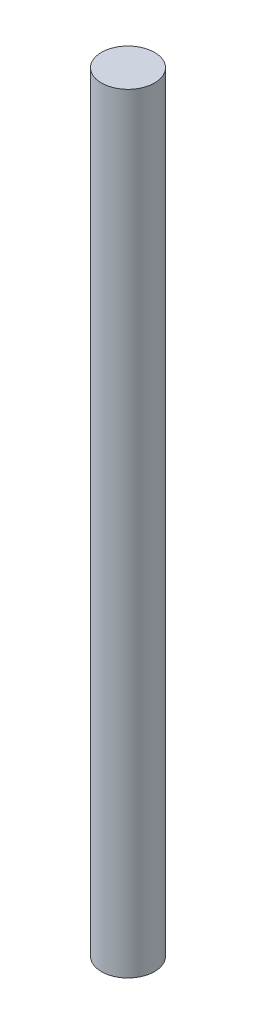
ISO-10303-21;
HEADER;
FILE_DESCRIPTION(('STEP AP214'),'2;1');
FILE_NAME('part.step','',(''),(''),'','','');
FILE_SCHEMA(('AUTOMOTIVE_DESIGN { 1 0 10303 214 1 1 1 1 }'));
ENDSEC;
DATA;
#1=APPLICATION_CONTEXT('core data for automotive mechanical design processes');
#2=APPLICATION_PROTOCOL_DEFINITION('international standard','automotive_design',2000,#1);
#3=PRODUCT_CONTEXT('',#1,'mechanical');
#4=PRODUCT('Part','Part','',(#3));
#5=PRODUCT_RELATED_PRODUCT_CATEGORY('part','',(#4));
#6=PRODUCT_DEFINITION_FORMATION('','',#4);
#7=PRODUCT_DEFINITION_CONTEXT('part definition',#1,'design');
#8=PRODUCT_DEFINITION('design','',#6,#7);
#9=PRODUCT_DEFINITION_SHAPE('','',#8);
#10=(LENGTH_UNIT() NAMED_UNIT(*) SI_UNIT(.MILLI.,.METRE.));
#11=(NAMED_UNIT(*) PLANE_ANGLE_UNIT() SI_UNIT($,.RADIAN.));
#12=(NAMED_UNIT(*) SI_UNIT($,.STERADIAN.) SOLID_ANGLE_UNIT());
#13=UNCERTAINTY_MEASURE_WITH_UNIT(LENGTH_MEASURE(1.E-05),#10,'distance_accuracy_value','');
#14=(GEOMETRIC_REPRESENTATION_CONTEXT(3) GLOBAL_UNCERTAINTY_ASSIGNED_CONTEXT((#13)) GLOBAL_UNIT_ASSIGNED_CONTEXT((#10,
#11,#12)) REPRESENTATION_CONTEXT('',''));
#15=CARTESIAN_POINT('',(0.,0.,0.));
#16=DIRECTION('',(0.,0.,1.));
#17=DIRECTION('',(1.,0.,0.));
#18=AXIS2_PLACEMENT_3D('',#15,#16,#17);
#19=CARTESIAN_POINT('',(0.,184.15,0.));
#20=DIRECTION('',(0.,-1.,0.));
#21=DIRECTION('',(0.,0.,-1.));
#22=AXIS2_PLACEMENT_3D('',#19,#20,#21);
#23=CYLINDRICAL_SURFACE('',#22,6.35);
#24=CARTESIAN_POINT('',(0.,184.15,0.));
#25=DIRECTION('',(0.,1.,0.));
#26=DIRECTION('',(0.,0.,1.));
#27=AXIS2_PLACEMENT_3D('',#24,#25,#26);
#28=CIRCLE('',#27,6.35);
#29=CARTESIAN_POINT('',(0.,184.15,6.35));
#30=VERTEX_POINT('',#29);
#31=EDGE_CURVE('E10',#30,#30,#28,.T.);
#32=ORIENTED_EDGE('',*,*,#31,.F.);
#33=EDGE_LOOP('',(#32));
#34=FACE_BOUND('',#33,.T.);
#35=CARTESIAN_POINT('',(0.,0.,0.));
#36=DIRECTION('',(0.,1.,0.));
#37=DIRECTION('',(0.,0.,1.));
#38=AXIS2_PLACEMENT_3D('',#35,#36,#37);
#39=CIRCLE('',#38,6.35);
#40=CARTESIAN_POINT('',(0.,0.,6.35));
#41=VERTEX_POINT('',#40);
#42=EDGE_CURVE('E35',#41,#41,#39,.T.);
#43=ORIENTED_EDGE('',*,*,#42,.T.);
#44=EDGE_LOOP('',(#43));
#45=FACE_BOUND('',#44,.T.);
#46=ADVANCED_FACE('F32',(#34,#45),#23,.T.);
#47=CARTESIAN_POINT('',(0.,184.15,0.));
#48=DIRECTION('',(0.,1.,0.));
#49=DIRECTION('',(0.,0.,1.));
#50=AXIS2_PLACEMENT_3D('',#47,#48,#49);
#51=PLANE('',#50);
#52=ORIENTED_EDGE('',*,*,#31,.T.);
#53=EDGE_LOOP('',(#52));
#54=FACE_BOUND('',#53,.T.);
#55=ADVANCED_FACE('F47',(#54),#51,.T.);
#56=CARTESIAN_POINT('',(0.,0.,0.));
#57=DIRECTION('',(0.,1.,0.));
#58=DIRECTION('',(0.,0.,1.));
#59=AXIS2_PLACEMENT_3D('',#56,#57,#58);
#60=PLANE('',#59);
#61=ORIENTED_EDGE('',*,*,#42,.F.);
#62=EDGE_LOOP('',(#61));
#63=FACE_BOUND('',#62,.T.);
#64=ADVANCED_FACE('F45',(#63),#60,.F.);
#65=CLOSED_SHELL('',(#46,#55,#64));
#66=MANIFOLD_SOLID_BREP('B2',#65);
#67=ADVANCED_BREP_SHAPE_REPRESENTATION('',(#18,#66),#14);
#68=SHAPE_DEFINITION_REPRESENTATION(#9,#67);
ENDSEC;
END-ISO-10303-21;
